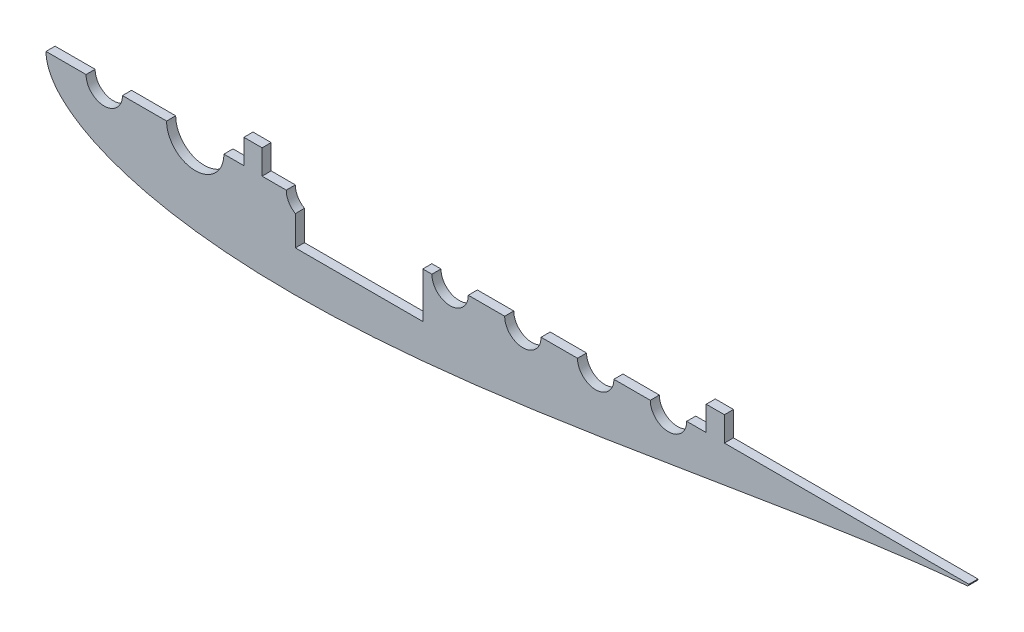
ISO-10303-21;
HEADER;
FILE_DESCRIPTION(('STEP AP214'),'2;1');
FILE_NAME('part.step','',(''),(''),'','','');
FILE_SCHEMA(('AUTOMOTIVE_DESIGN { 1 0 10303 214 1 1 1 1 }'));
ENDSEC;
DATA;
#1=APPLICATION_CONTEXT('core data for automotive mechanical design processes');
#2=APPLICATION_PROTOCOL_DEFINITION('international standard','automotive_design',2000,#1);
#3=PRODUCT_CONTEXT('',#1,'mechanical');
#4=PRODUCT('Part','Part','',(#3));
#5=PRODUCT_RELATED_PRODUCT_CATEGORY('part','',(#4));
#6=PRODUCT_DEFINITION_FORMATION('','',#4);
#7=PRODUCT_DEFINITION_CONTEXT('part definition',#1,'design');
#8=PRODUCT_DEFINITION('design','',#6,#7);
#9=PRODUCT_DEFINITION_SHAPE('','',#8);
#10=(LENGTH_UNIT() NAMED_UNIT(*) SI_UNIT(.MILLI.,.METRE.));
#11=(NAMED_UNIT(*) PLANE_ANGLE_UNIT() SI_UNIT($,.RADIAN.));
#12=(NAMED_UNIT(*) SI_UNIT($,.STERADIAN.) SOLID_ANGLE_UNIT());
#13=UNCERTAINTY_MEASURE_WITH_UNIT(LENGTH_MEASURE(1.E-05),#10,'distance_accuracy_value','');
#14=(GEOMETRIC_REPRESENTATION_CONTEXT(3) GLOBAL_UNCERTAINTY_ASSIGNED_CONTEXT((#13)) GLOBAL_UNIT_ASSIGNED_CONTEXT((#10,
#11,#12)) REPRESENTATION_CONTEXT('',''));
#15=CARTESIAN_POINT('',(0.,0.,0.));
#16=DIRECTION('',(0.,0.,1.));
#17=DIRECTION('',(1.,0.,0.));
#18=AXIS2_PLACEMENT_3D('',#15,#16,#17);
#19=CARTESIAN_POINT('',(0.,0.,6.35));
#20=DIRECTION('',(0.,1.,0.));
#21=DIRECTION('',(0.,0.,1.));
#22=AXIS2_PLACEMENT_3D('',#19,#20,#21);
#23=PLANE('',#22);
#24=DIRECTION('',(1.,0.,0.));
#25=VECTOR('',#24,1.);
#26=CARTESIAN_POINT('',(0.,0.,0.));
#27=LINE('',#26,#25);
#28=CARTESIAN_POINT('',(0.,0.,0.));
#29=VERTEX_POINT('',#28);
#30=CARTESIAN_POINT('',(27.94,0.,0.));
#31=VERTEX_POINT('',#30);
#32=EDGE_CURVE('E323',#29,#31,#27,.T.);
#33=ORIENTED_EDGE('',*,*,#32,.F.);
#34=DIRECTION('',(0.,0.,-1.));
#35=VECTOR('',#34,1.);
#36=CARTESIAN_POINT('',(0.,0.,6.35));
#37=LINE('',#36,#35);
#38=CARTESIAN_POINT('',(0.,0.,6.35));
#39=VERTEX_POINT('',#38);
#40=EDGE_CURVE('E11',#39,#29,#37,.T.);
#41=ORIENTED_EDGE('',*,*,#40,.F.);
#42=DIRECTION('',(1.,0.,0.));
#43=VECTOR('',#42,1.);
#44=CARTESIAN_POINT('',(0.,0.,6.35));
#45=LINE('',#44,#43);
#46=CARTESIAN_POINT('',(27.94,0.,6.35));
#47=VERTEX_POINT('',#46);
#48=EDGE_CURVE('E247',#39,#47,#45,.T.);
#49=ORIENTED_EDGE('',*,*,#48,.T.);
#50=DIRECTION('',(0.,0.,-1.));
#51=VECTOR('',#50,1.);
#52=CARTESIAN_POINT('',(27.94,0.,6.35));
#53=LINE('',#52,#51);
#54=EDGE_CURVE('E52',#47,#31,#53,.T.);
#55=ORIENTED_EDGE('',*,*,#54,.T.);
#56=EDGE_LOOP('',(#33,#41,#49,#55));
#57=FACE_BOUND('',#56,.T.);
#58=ADVANCED_FACE('F34',(#57),#23,.T.);
#59=CARTESIAN_POINT('',(670.56,0.,6.35));
#60=CARTESIAN_POINT('',(670.56,0.0156785949268131,6.35));
#61=CARTESIAN_POINT('',(666.344759682885,0.0546967077380254,6.35));
#62=CARTESIAN_POINT('',(662.850933167967,0.234427605388554,6.35));
#63=CARTESIAN_POINT('',(656.504964310749,0.543558382914671,6.35));
#64=CARTESIAN_POINT('',(649.292951764021,1.03477125279464,6.35));
#65=CARTESIAN_POINT('',(640.49155963975,1.73191957841822,6.35));
#66=CARTESIAN_POINT('',(630.413817461935,2.6633854932203,6.35));
#67=CARTESIAN_POINT('',(619.014124193102,3.84925366408521,6.35));
#68=CARTESIAN_POINT('',(606.37498851238,5.30442898343123,6.35));
#69=CARTESIAN_POINT('',(592.543922516217,7.03763490710039,6.35));
#70=CARTESIAN_POINT('',(577.585454095337,9.05063614704163,6.35));
#71=CARTESIAN_POINT('',(561.564270734499,11.338919624911,6.35));
#72=CARTESIAN_POINT('',(544.549749945783,13.8906653749143,6.35));
#73=CARTESIAN_POINT('',(526.614143657614,16.687720752969,6.35));
#74=CARTESIAN_POINT('',(507.832591566438,19.705111662944,6.35));
#75=CARTESIAN_POINT('',(488.28271028846,22.9116726009051,6.35));
#76=CARTESIAN_POINT('',(468.04436773457,26.2704360601485,6.35));
#77=CARTESIAN_POINT('',(447.199424328287,29.7390074319526,6.35));
#78=CARTESIAN_POINT('',(425.831595832134,33.2703241206413,6.35));
#79=CARTESIAN_POINT('',(404.026315660115,36.8132205450789,6.35));
#80=CARTESIAN_POINT('',(381.870662855574,40.3132668564462,6.35));
#81=CARTESIAN_POINT('',(359.45331489519,43.7135025323023,6.35));
#82=CARTESIAN_POINT('',(336.864544150043,46.9554474567625,6.35));
#83=CARTESIAN_POINT('',(314.196207315012,49.9798438951445,6.35));
#84=CARTESIAN_POINT('',(291.541767703989,52.7277127038914,6.35));
#85=CARTESIAN_POINT('',(268.996310773138,55.1412010116265,6.35));
#86=CARTESIAN_POINT('',(246.656558649997,57.164603828805,6.35));
#87=CARTESIAN_POINT('',(224.620860897201,58.7451766411797,6.35));
#88=CARTESIAN_POINT('',(202.989192599403,59.8341217002378,6.35));
#89=CARTESIAN_POINT('',(181.863132616042,60.38750614212,6.35));
#90=CARTESIAN_POINT('',(161.345829026568,60.3669613241372,6.35));
#91=CARTESIAN_POINT('',(141.542033827972,59.7398958243377,6.35));
#92=CARTESIAN_POINT('',(122.558104572902,58.4817581038394,6.35));
#93=CARTESIAN_POINT('',(104.502313427195,56.5743039322433,6.35));
#94=CARTESIAN_POINT('',(87.4850186361547,54.0089351991654,6.35));
#95=CARTESIAN_POINT('',(71.6196960831899,50.7847520029957,6.35));
#96=CARTESIAN_POINT('',(57.0237097246999,46.9125430655859,6.35));
#97=CARTESIAN_POINT('',(43.8204543300276,42.4150024601016,6.35));
#98=CARTESIAN_POINT('',(32.1416452388822,37.3322040286461,6.35));
#99=CARTESIAN_POINT('',(22.1291073753192,31.7314553388245,6.35));
#100=CARTESIAN_POINT('',(13.9324235239131,25.7264121059535,6.35));
#101=CARTESIAN_POINT('',(7.6896164890983,19.5132076319135,6.35));
#102=CARTESIAN_POINT('',(3.46313634309125,13.420354420661,6.35));
#103=CARTESIAN_POINT('',(1.10633322756685,7.92338943472272,6.35));
#104=CARTESIAN_POINT('',(0.15461158157361,3.51379661507287,6.35));
#105=CARTESIAN_POINT('',(-0.0621515976067641,1.5591281566194E-13,6.35));
#106=CARTESIAN_POINT('',(0.154611581573626,-3.51379661507311,6.35));
#107=CARTESIAN_POINT('',(1.10633322756686,-7.92338943472269,6.35));
#108=CARTESIAN_POINT('',(3.46313634309125,-13.420354420661,6.35));
#109=CARTESIAN_POINT('',(7.68961648909825,-19.5132076319134,6.35));
#110=CARTESIAN_POINT('',(13.9324235239131,-25.7264121059535,6.35));
#111=CARTESIAN_POINT('',(22.1291073753193,-31.7314553388245,6.35));
#112=CARTESIAN_POINT('',(32.1416452388821,-37.3322040286461,6.35));
#113=CARTESIAN_POINT('',(43.8204543300276,-42.4150024601017,6.35));
#114=CARTESIAN_POINT('',(57.0237097246998,-46.9125430655859,6.35));
#115=CARTESIAN_POINT('',(71.6196960831899,-50.7847520029958,6.35));
#116=CARTESIAN_POINT('',(87.4850186361546,-54.0089351991654,6.35));
#117=CARTESIAN_POINT('',(104.502313427195,-56.5743039322434,6.35));
#118=CARTESIAN_POINT('',(122.558104572901,-58.4817581038394,6.35));
#119=CARTESIAN_POINT('',(141.542033827972,-59.7398958243377,6.35));
#120=CARTESIAN_POINT('',(161.345829026568,-60.3669613241371,6.35));
#121=CARTESIAN_POINT('',(181.863132616042,-60.38750614212,6.35));
#122=CARTESIAN_POINT('',(202.989192599403,-59.8341217002379,6.35));
#123=CARTESIAN_POINT('',(224.620860897201,-58.7451766411797,6.35));
#124=CARTESIAN_POINT('',(246.656558649997,-57.164603828805,6.35));
#125=CARTESIAN_POINT('',(268.996310773138,-55.1412010116265,6.35));
#126=CARTESIAN_POINT('',(291.541767703989,-52.7277127038914,6.35));
#127=CARTESIAN_POINT('',(314.196207315012,-49.9798438951445,6.35));
#128=CARTESIAN_POINT('',(336.864544150043,-46.9554474567625,6.35));
#129=CARTESIAN_POINT('',(359.45331489519,-43.7135025323023,6.35));
#130=CARTESIAN_POINT('',(381.870662855574,-40.3132668564462,6.35));
#131=CARTESIAN_POINT('',(404.026315660115,-36.8132205450789,6.35));
#132=CARTESIAN_POINT('',(425.831595832134,-33.2703241206413,6.35));
#133=CARTESIAN_POINT('',(447.199424328287,-29.7390074319526,6.35));
#134=CARTESIAN_POINT('',(468.04436773457,-26.2704360601485,6.35));
#135=CARTESIAN_POINT('',(488.28271028846,-22.911672600905,6.35));
#136=CARTESIAN_POINT('',(507.832591566438,-19.7051116629441,6.35));
#137=CARTESIAN_POINT('',(526.614143657614,-16.687720752969,6.35));
#138=CARTESIAN_POINT('',(544.549749945782,-13.8906653749143,6.35));
#139=CARTESIAN_POINT('',(561.564270734499,-11.338919624911,6.35));
#140=CARTESIAN_POINT('',(577.585454095337,-9.05063614704163,6.35));
#141=CARTESIAN_POINT('',(592.543922516217,-7.03763490710038,6.35));
#142=CARTESIAN_POINT('',(606.37498851238,-5.30442898343123,6.35));
#143=CARTESIAN_POINT('',(619.014124193101,-3.84925366408522,6.35));
#144=CARTESIAN_POINT('',(630.413817461935,-2.6633854932203,6.35));
#145=CARTESIAN_POINT('',(640.491559639751,-1.73191957841821,6.35));
#146=CARTESIAN_POINT('',(649.29295176402,-1.03477125279464,6.35));
#147=CARTESIAN_POINT('',(656.504964310749,-0.543558382914674,6.35));
#148=CARTESIAN_POINT('',(662.850933167967,-0.23442760538855,6.35));
#149=CARTESIAN_POINT('',(666.344759682885,-0.0546967077380269,6.35));
#150=CARTESIAN_POINT('',(670.56,-0.0156785949268135,6.35));
#151=CARTESIAN_POINT('',(670.56,0.,6.35));
#152=B_SPLINE_CURVE_WITH_KNOTS('',3,(#59,#60,#61,#62,#63,#64,#65,#66,#67,#68,#69,#70,#71,#72,
#73,#74,#75,#76,#77,#78,#79,#80,#81,#82,#83,#84,#85,#86,#87,#88,#89,#90,#91,#92,#93,#94,#95,#96,
#97,#98,#99,#100,#101,#102,#103,#104,#105,#106,#107,#108,#109,#110,#111,#112,#113,#114,#115,
#116,#117,#118,#119,#120,#121,#122,#123,#124,#125,#126,#127,#128,#129,#130,#131,#132,#133,#134,
#135,#136,#137,#138,#139,#140,#141,#142,#143,#144,#145,#146,#147,#148,#149,#150,#151),
.UNSPECIFIED.,.T.,.F.,(4,1,1,1,1,1,1,1,1,1,1,1,1,1,1,1,1,1,1,1,1,1,1,1,1,1,1,1,1,1,1,1,1,1,1,1,
1,1,1,1,1,1,1,1,1,1,1,1,1,1,1,1,1,1,1,1,1,1,1,1,1,1,1,1,1,1,1,1,1,1,1,1,1,1,1,1,1,1,1,1,1,1,1,1,
1,1,1,1,1,1,4),(0.,0.00216777795588342,0.00539478220000884,0.00966720698444134,
0.0149667883303173,0.0212708876900959,0.0285525550130683,0.0367806836725549,0.0459201019032637,
0.0559317636633187,0.0667728836144854,0.0783971303496518,0.0907548266908363,0.103793164577546,
0.117456431914319,0.131686225652521,0.146421738497113,0.161599998000845,0.177156132626574,
0.193023668070302,0.209134785631037,0.225420632511523,0.241811601924249,0.258237646860869,
0.274628556698349,0.290914287398014,0.307025228908797,0.322892517177238,0.33844834182358,
0.353626206573582,0.368361231970712,0.382590427827798,0.396252960572084,0.40929041186716,
0.421647009590256,0.433269881487031,0.444109248914041,0.454118639688981,0.463255054987312,
0.471479113777303,0.478755288570903,0.485052318112802,0.490344025694165,0.494609832614287,
0.497833231437255,0.5,0.502166768562745,0.505390167385713,0.509655974305835,0.514947681887198,
0.521244711429097,0.528520886222697,0.536744945012688,0.545881360311019,0.555890751085959,
0.566730118512969,0.578352990409744,0.59070958813284,0.603747039427916,0.617409572172202,
0.631638768029288,0.646373793426418,0.66155165817642,0.677107482822761,0.692974771091203,
0.709085712601986,0.725371443301651,0.741762353139131,0.758188398075751,0.774579367488477,
0.790865214368963,0.806976331929698,0.822843867373426,0.838400001999155,0.853578261502887,
0.868313774347479,0.882543568085681,0.896206835422454,0.909245173309164,0.921602869650348,
0.933227116385514,0.944068236336681,0.954079898096736,0.963219316327445,0.971447444986932,
0.978729112309904,0.985033211669683,0.990332793015559,0.994605217799991,0.997832222044117,1.),.UNSPECIFIED.);
#153=DIRECTION('',(0.,0.,-1.));
#154=VECTOR('',#153,1.);
#155=SURFACE_OF_LINEAR_EXTRUSION('',#152,#154);
#156=CARTESIAN_POINT('',(670.56,0.,0.));
#157=CARTESIAN_POINT('',(670.56,0.0156785949268131,0.));
#158=CARTESIAN_POINT('',(666.344759682885,0.0546967077380254,0.));
#159=CARTESIAN_POINT('',(662.850933167967,0.234427605388554,0.));
#160=CARTESIAN_POINT('',(656.504964310749,0.543558382914671,0.));
#161=CARTESIAN_POINT('',(649.292951764021,1.03477125279464,0.));
#162=CARTESIAN_POINT('',(640.49155963975,1.73191957841822,0.));
#163=CARTESIAN_POINT('',(630.413817461935,2.6633854932203,0.));
#164=CARTESIAN_POINT('',(619.014124193102,3.84925366408521,0.));
#165=CARTESIAN_POINT('',(606.37498851238,5.30442898343123,0.));
#166=CARTESIAN_POINT('',(592.543922516217,7.03763490710039,0.));
#167=CARTESIAN_POINT('',(577.585454095337,9.05063614704163,0.));
#168=CARTESIAN_POINT('',(561.564270734499,11.338919624911,0.));
#169=CARTESIAN_POINT('',(544.549749945783,13.8906653749143,0.));
#170=CARTESIAN_POINT('',(526.614143657614,16.687720752969,0.));
#171=CARTESIAN_POINT('',(507.832591566438,19.705111662944,0.));
#172=CARTESIAN_POINT('',(488.28271028846,22.9116726009051,0.));
#173=CARTESIAN_POINT('',(468.04436773457,26.2704360601485,0.));
#174=CARTESIAN_POINT('',(447.199424328287,29.7390074319526,0.));
#175=CARTESIAN_POINT('',(425.831595832134,33.2703241206413,0.));
#176=CARTESIAN_POINT('',(404.026315660115,36.8132205450789,0.));
#177=CARTESIAN_POINT('',(381.870662855574,40.3132668564462,0.));
#178=CARTESIAN_POINT('',(359.45331489519,43.7135025323023,0.));
#179=CARTESIAN_POINT('',(336.864544150043,46.9554474567625,0.));
#180=CARTESIAN_POINT('',(314.196207315012,49.9798438951445,0.));
#181=CARTESIAN_POINT('',(291.541767703989,52.7277127038914,0.));
#182=CARTESIAN_POINT('',(268.996310773138,55.1412010116265,0.));
#183=CARTESIAN_POINT('',(246.656558649997,57.164603828805,0.));
#184=CARTESIAN_POINT('',(224.620860897201,58.7451766411797,0.));
#185=CARTESIAN_POINT('',(202.989192599403,59.8341217002378,0.));
#186=CARTESIAN_POINT('',(181.863132616042,60.38750614212,0.));
#187=CARTESIAN_POINT('',(161.345829026568,60.3669613241372,0.));
#188=CARTESIAN_POINT('',(141.542033827972,59.7398958243377,0.));
#189=CARTESIAN_POINT('',(122.558104572902,58.4817581038394,0.));
#190=CARTESIAN_POINT('',(104.502313427195,56.5743039322433,0.));
#191=CARTESIAN_POINT('',(87.4850186361547,54.0089351991654,0.));
#192=CARTESIAN_POINT('',(71.6196960831899,50.7847520029957,0.));
#193=CARTESIAN_POINT('',(57.0237097246999,46.9125430655859,0.));
#194=CARTESIAN_POINT('',(43.8204543300276,42.4150024601016,0.));
#195=CARTESIAN_POINT('',(32.1416452388822,37.3322040286461,0.));
#196=CARTESIAN_POINT('',(22.1291073753192,31.7314553388245,0.));
#197=CARTESIAN_POINT('',(13.9324235239131,25.7264121059535,0.));
#198=CARTESIAN_POINT('',(7.6896164890983,19.5132076319135,0.));
#199=CARTESIAN_POINT('',(3.46313634309125,13.420354420661,0.));
#200=CARTESIAN_POINT('',(1.10633322756685,7.92338943472272,0.));
#201=CARTESIAN_POINT('',(0.15461158157361,3.51379661507287,0.));
#202=CARTESIAN_POINT('',(-0.0621515976067641,1.5591281566194E-13,0.));
#203=CARTESIAN_POINT('',(0.154611581573626,-3.51379661507311,0.));
#204=CARTESIAN_POINT('',(1.10633322756686,-7.92338943472269,0.));
#205=CARTESIAN_POINT('',(3.46313634309125,-13.420354420661,0.));
#206=CARTESIAN_POINT('',(7.68961648909825,-19.5132076319134,0.));
#207=CARTESIAN_POINT('',(13.9324235239131,-25.7264121059535,0.));
#208=CARTESIAN_POINT('',(22.1291073753193,-31.7314553388245,0.));
#209=CARTESIAN_POINT('',(32.1416452388821,-37.3322040286461,0.));
#210=CARTESIAN_POINT('',(43.8204543300276,-42.4150024601017,0.));
#211=CARTESIAN_POINT('',(57.0237097246998,-46.9125430655859,0.));
#212=CARTESIAN_POINT('',(71.6196960831899,-50.7847520029958,0.));
#213=CARTESIAN_POINT('',(87.4850186361546,-54.0089351991654,0.));
#214=CARTESIAN_POINT('',(104.502313427195,-56.5743039322434,0.));
#215=CARTESIAN_POINT('',(122.558104572901,-58.4817581038394,0.));
#216=CARTESIAN_POINT('',(141.542033827972,-59.7398958243377,0.));
#217=CARTESIAN_POINT('',(161.345829026568,-60.3669613241371,0.));
#218=CARTESIAN_POINT('',(181.863132616042,-60.38750614212,0.));
#219=CARTESIAN_POINT('',(202.989192599403,-59.8341217002379,0.));
#220=CARTESIAN_POINT('',(224.620860897201,-58.7451766411797,0.));
#221=CARTESIAN_POINT('',(246.656558649997,-57.164603828805,0.));
#222=CARTESIAN_POINT('',(268.996310773138,-55.1412010116265,0.));
#223=CARTESIAN_POINT('',(291.541767703989,-52.7277127038914,0.));
#224=CARTESIAN_POINT('',(314.196207315012,-49.9798438951445,0.));
#225=CARTESIAN_POINT('',(336.864544150043,-46.9554474567625,0.));
#226=CARTESIAN_POINT('',(359.45331489519,-43.7135025323023,0.));
#227=CARTESIAN_POINT('',(381.870662855574,-40.3132668564462,0.));
#228=CARTESIAN_POINT('',(404.026315660115,-36.8132205450789,0.));
#229=CARTESIAN_POINT('',(425.831595832134,-33.2703241206413,0.));
#230=CARTESIAN_POINT('',(447.199424328287,-29.7390074319526,0.));
#231=CARTESIAN_POINT('',(468.04436773457,-26.2704360601485,0.));
#232=CARTESIAN_POINT('',(488.28271028846,-22.911672600905,0.));
#233=CARTESIAN_POINT('',(507.832591566438,-19.7051116629441,0.));
#234=CARTESIAN_POINT('',(526.614143657614,-16.687720752969,0.));
#235=CARTESIAN_POINT('',(544.549749945782,-13.8906653749143,0.));
#236=CARTESIAN_POINT('',(561.564270734499,-11.338919624911,0.));
#237=CARTESIAN_POINT('',(577.585454095337,-9.05063614704163,0.));
#238=CARTESIAN_POINT('',(592.543922516217,-7.03763490710038,0.));
#239=CARTESIAN_POINT('',(606.37498851238,-5.30442898343123,0.));
#240=CARTESIAN_POINT('',(619.014124193101,-3.84925366408522,0.));
#241=CARTESIAN_POINT('',(630.413817461935,-2.6633854932203,0.));
#242=CARTESIAN_POINT('',(640.491559639751,-1.73191957841821,0.));
#243=CARTESIAN_POINT('',(649.29295176402,-1.03477125279464,0.));
#244=CARTESIAN_POINT('',(656.504964310749,-0.543558382914674,0.));
#245=CARTESIAN_POINT('',(662.850933167967,-0.23442760538855,0.));
#246=CARTESIAN_POINT('',(666.344759682885,-0.0546967077380269,0.));
#247=CARTESIAN_POINT('',(670.56,-0.0156785949268135,0.));
#248=CARTESIAN_POINT('',(670.56,0.,0.));
#249=B_SPLINE_CURVE_WITH_KNOTS('',3,(#156,#157,#158,#159,#160,#161,#162,#163,#164,#165,#166,
#167,#168,#169,#170,#171,#172,#173,#174,#175,#176,#177,#178,#179,#180,#181,#182,#183,#184,#185,
#186,#187,#188,#189,#190,#191,#192,#193,#194,#195,#196,#197,#198,#199,#200,#201,#202,#203,#204,
#205,#206,#207,#208,#209,#210,#211,#212,#213,#214,#215,#216,#217,#218,#219,#220,#221,#222,#223,
#224,#225,#226,#227,#228,#229,#230,#231,#232,#233,#234,#235,#236,#237,#238,#239,#240,#241,#242,
#243,#244,#245,#246,#247,#248),.UNSPECIFIED.,.T.,.F.,(4,1,1,1,1,1,1,1,1,1,1,1,1,1,1,1,1,1,1,1,1,
1,1,1,1,1,1,1,1,1,1,1,1,1,1,1,1,1,1,1,1,1,1,1,1,1,1,1,1,1,1,1,1,1,1,1,1,1,1,1,1,1,1,1,1,1,1,1,1,
1,1,1,1,1,1,1,1,1,1,1,1,1,1,1,1,1,1,1,1,1,4),(0.,0.00216777795588342,0.00539478220000884,
0.00966720698444134,0.0149667883303173,0.0212708876900959,0.0285525550130683,0.0367806836725549,
0.0459201019032637,0.0559317636633187,0.0667728836144854,0.0783971303496518,0.0907548266908363,
0.103793164577546,0.117456431914319,0.131686225652521,0.146421738497113,0.161599998000845,
0.177156132626574,0.193023668070302,0.209134785631037,0.225420632511523,0.241811601924249,
0.258237646860869,0.274628556698349,0.290914287398014,0.307025228908797,0.322892517177238,
0.33844834182358,0.353626206573582,0.368361231970712,0.382590427827798,0.396252960572084,
0.40929041186716,0.421647009590256,0.433269881487031,0.444109248914041,0.454118639688981,
0.463255054987312,0.471479113777303,0.478755288570903,0.485052318112802,0.490344025694165,
0.494609832614287,0.497833231437255,0.5,0.502166768562745,0.505390167385713,0.509655974305835,
0.514947681887198,0.521244711429097,0.528520886222697,0.536744945012688,0.545881360311019,
0.555890751085959,0.566730118512969,0.578352990409744,0.59070958813284,0.603747039427916,
0.617409572172202,0.631638768029288,0.646373793426418,0.66155165817642,0.677107482822761,
0.692974771091203,0.709085712601986,0.725371443301651,0.741762353139131,0.758188398075751,
0.774579367488477,0.790865214368963,0.806976331929698,0.822843867373426,0.838400001999155,
0.853578261502887,0.868313774347479,0.882543568085681,0.896206835422454,0.909245173309164,
0.921602869650348,0.933227116385514,0.944068236336681,0.954079898096736,0.963219316327445,
0.971447444986932,0.978729112309904,0.985033211669683,0.990332793015559,0.994605217799991,
0.997832222044117,1.),.UNSPECIFIED.);
#250=CARTESIAN_POINT('',(642.510849283044,-1.58203911233971,0.));
#251=VERTEX_POINT('',#250);
#252=EDGE_CURVE('E325',#29,#251,#249,.T.);
#253=ORIENTED_EDGE('',*,*,#252,.T.);
#254=DIRECTION('',(0.,0.,-1.));
#255=VECTOR('',#254,1.);
#256=CARTESIAN_POINT('',(642.510849283044,-1.58203911233971,6.35));
#257=LINE('',#256,#255);
#258=CARTESIAN_POINT('',(642.510849283044,-1.58203911233971,6.35));
#259=VERTEX_POINT('',#258);
#260=EDGE_CURVE('E44',#259,#251,#257,.T.);
#261=ORIENTED_EDGE('',*,*,#260,.F.);
#262=EDGE_CURVE('E251',#39,#259,#152,.T.);
#263=ORIENTED_EDGE('',*,*,#262,.F.);
#264=ORIENTED_EDGE('',*,*,#40,.T.);
#265=EDGE_LOOP('',(#253,#261,#263,#264));
#266=FACE_BOUND('',#265,.T.);
#267=ADVANCED_FACE('F36',(#266),#155,.F.);
#268=CARTESIAN_POINT('',(642.379287521778,0.,6.35));
#269=DIRECTION('',(0.,0.,-1.));
#270=DIRECTION('',(-1.,0.,0.));
#271=AXIS2_PLACEMENT_3D('',#268,#269,#270);
#272=CYLINDRICAL_SURFACE('',#271,1.58750000000001);
#273=CARTESIAN_POINT('',(642.379287521778,0.,0.));
#274=DIRECTION('',(0.,0.,1.));
#275=DIRECTION('',(1.,0.,0.));
#276=AXIS2_PLACEMENT_3D('',#273,#274,#275);
#277=CIRCLE('',#276,1.58750000000001);
#278=CARTESIAN_POINT('',(643.966787521778,0.,0.));
#279=VERTEX_POINT('',#278);
#280=EDGE_CURVE('E330',#251,#279,#277,.T.);
#281=ORIENTED_EDGE('',*,*,#280,.T.);
#282=DIRECTION('',(0.,0.,-1.));
#283=VECTOR('',#282,1.);
#284=CARTESIAN_POINT('',(643.966787521778,0.,6.35));
#285=LINE('',#284,#283);
#286=CARTESIAN_POINT('',(643.966787521778,0.,6.35));
#287=VERTEX_POINT('',#286);
#288=EDGE_CURVE('E431',#287,#279,#285,.T.);
#289=ORIENTED_EDGE('',*,*,#288,.F.);
#290=CARTESIAN_POINT('',(642.379287521778,0.,6.35));
#291=DIRECTION('',(0.,0.,1.));
#292=DIRECTION('',(1.,0.,0.));
#293=AXIS2_PLACEMENT_3D('',#290,#291,#292);
#294=CIRCLE('',#293,1.58750000000001);
#295=EDGE_CURVE('E254',#259,#287,#294,.T.);
#296=ORIENTED_EDGE('',*,*,#295,.F.);
#297=ORIENTED_EDGE('',*,*,#260,.T.);
#298=EDGE_LOOP('',(#281,#289,#296,#297));
#299=FACE_BOUND('',#298,.T.);
#300=ADVANCED_FACE('F437',(#299),#272,.T.);
#301=CARTESIAN_POINT('',(473.360965278708,0.,0.));
#302=VERTEX_POINT('',#301);
#303=EDGE_CURVE('E326',#302,#279,#27,.T.);
#304=ORIENTED_EDGE('',*,*,#303,.F.);
#305=DIRECTION('',(0.,0.,-1.));
#306=VECTOR('',#305,1.);
#307=CARTESIAN_POINT('',(473.360965278708,0.,6.35));
#308=LINE('',#307,#306);
#309=CARTESIAN_POINT('',(473.360965278708,0.,6.35));
#310=VERTEX_POINT('',#309);
#311=EDGE_CURVE('E429',#310,#302,#308,.T.);
#312=ORIENTED_EDGE('',*,*,#311,.F.);
#313=EDGE_CURVE('E253',#310,#287,#45,.T.);
#314=ORIENTED_EDGE('',*,*,#313,.T.);
#315=ORIENTED_EDGE('',*,*,#288,.T.);
#316=EDGE_LOOP('',(#304,#312,#314,#315));
#317=FACE_BOUND('',#316,.T.);
#318=ADVANCED_FACE('F474',(#317),#23,.T.);
#319=CARTESIAN_POINT('',(473.360965278708,0.,6.35));
#320=DIRECTION('',(-1.,0.,0.));
#321=DIRECTION('',(0.,0.,1.));
#322=AXIS2_PLACEMENT_3D('',#319,#320,#321);
#323=PLANE('',#322);
#324=DIRECTION('',(0.,1.,0.));
#325=VECTOR('',#324,1.);
#326=CARTESIAN_POINT('',(473.360965278708,0.,0.));
#327=LINE('',#326,#325);
#328=CARTESIAN_POINT('',(473.360965278708,17.145,0.));
#329=VERTEX_POINT('',#328);
#330=EDGE_CURVE('E336',#302,#329,#327,.T.);
#331=ORIENTED_EDGE('',*,*,#330,.T.);
#332=DIRECTION('',(0.,0.,-1.));
#333=VECTOR('',#332,1.);
#334=CARTESIAN_POINT('',(473.360965278708,17.145,6.35));
#335=LINE('',#334,#333);
#336=CARTESIAN_POINT('',(473.360965278708,17.145,6.35));
#337=VERTEX_POINT('',#336);
#338=EDGE_CURVE('E427',#337,#329,#335,.T.);
#339=ORIENTED_EDGE('',*,*,#338,.F.);
#340=DIRECTION('',(0.,1.,0.));
#341=VECTOR('',#340,1.);
#342=CARTESIAN_POINT('',(473.360965278708,0.,6.35));
#343=LINE('',#342,#341);
#344=EDGE_CURVE('E259',#310,#337,#343,.T.);
#345=ORIENTED_EDGE('',*,*,#344,.F.);
#346=ORIENTED_EDGE('',*,*,#311,.T.);
#347=EDGE_LOOP('',(#331,#339,#345,#346));
#348=FACE_BOUND('',#347,.T.);
#349=ADVANCED_FACE('F480',(#348),#323,.F.);
#350=CARTESIAN_POINT('',(0.,17.145,6.35));
#351=DIRECTION('',(0.,1.,0.));
#352=DIRECTION('',(0.,0.,1.));
#353=AXIS2_PLACEMENT_3D('',#350,#351,#352);
#354=PLANE('',#353);
#355=DIRECTION('',(1.,0.,0.));
#356=VECTOR('',#355,1.);
#357=CARTESIAN_POINT('',(0.,17.145,0.));
#358=LINE('',#357,#356);
#359=CARTESIAN_POINT('',(460.660965278708,17.145,0.));
#360=VERTEX_POINT('',#359);
#361=EDGE_CURVE('E339',#360,#329,#358,.T.);
#362=ORIENTED_EDGE('',*,*,#361,.F.);
#363=DIRECTION('',(0.,0.,-1.));
#364=VECTOR('',#363,1.);
#365=CARTESIAN_POINT('',(460.660965278708,17.145,6.35));
#366=LINE('',#365,#364);
#367=CARTESIAN_POINT('',(460.660965278708,17.145,6.35));
#368=VERTEX_POINT('',#367);
#369=EDGE_CURVE('E425',#368,#360,#366,.T.);
#370=ORIENTED_EDGE('',*,*,#369,.F.);
#371=DIRECTION('',(1.,0.,0.));
#372=VECTOR('',#371,1.);
#373=CARTESIAN_POINT('',(0.,17.145,6.35));
#374=LINE('',#373,#372);
#375=EDGE_CURVE('E263',#368,#337,#374,.T.);
#376=ORIENTED_EDGE('',*,*,#375,.T.);
#377=ORIENTED_EDGE('',*,*,#338,.T.);
#378=EDGE_LOOP('',(#362,#370,#376,#377));
#379=FACE_BOUND('',#378,.T.);
#380=ADVANCED_FACE('F486',(#379),#354,.T.);
#381=CARTESIAN_POINT('',(460.660965278708,1.49150309185906E-12,6.35));
#382=DIRECTION('',(-1.,0.,0.));
#383=DIRECTION('',(0.,-1.,0.));
#384=AXIS2_PLACEMENT_3D('',#381,#382,#383);
#385=PLANE('',#384);
#386=DIRECTION('',(0.,1.,0.));
#387=VECTOR('',#386,1.);
#388=CARTESIAN_POINT('',(460.660965278708,1.49150309185906E-12,0.));
#389=LINE('',#388,#387);
#390=CARTESIAN_POINT('',(460.660965278708,0.,0.));
#391=VERTEX_POINT('',#390);
#392=EDGE_CURVE('E342',#391,#360,#389,.T.);
#393=ORIENTED_EDGE('',*,*,#392,.F.);
#394=DIRECTION('',(0.,0.,-1.));
#395=VECTOR('',#394,1.);
#396=CARTESIAN_POINT('',(460.660965278708,0.,6.35));
#397=LINE('',#396,#395);
#398=CARTESIAN_POINT('',(460.660965278708,0.,6.35));
#399=VERTEX_POINT('',#398);
#400=EDGE_CURVE('E423',#399,#391,#397,.T.);
#401=ORIENTED_EDGE('',*,*,#400,.F.);
#402=DIRECTION('',(0.,1.,0.));
#403=VECTOR('',#402,1.);
#404=CARTESIAN_POINT('',(460.660965278708,1.49150309185906E-12,6.35));
#405=LINE('',#404,#403);
#406=EDGE_CURVE('E268',#399,#368,#405,.T.);
#407=ORIENTED_EDGE('',*,*,#406,.T.);
#408=ORIENTED_EDGE('',*,*,#369,.T.);
#409=EDGE_LOOP('',(#393,#401,#407,#408));
#410=FACE_BOUND('',#409,.T.);
#411=ADVANCED_FACE('F491',(#410),#385,.T.);
#412=CARTESIAN_POINT('',(447.04,0.,0.));
#413=VERTEX_POINT('',#412);
#414=EDGE_CURVE('E345',#413,#391,#27,.T.);
#415=ORIENTED_EDGE('',*,*,#414,.F.);
#416=DIRECTION('',(0.,0.,-1.));
#417=VECTOR('',#416,1.);
#418=CARTESIAN_POINT('',(447.04,0.,6.35));
#419=LINE('',#418,#417);
#420=CARTESIAN_POINT('',(447.04,0.,6.35));
#421=VERTEX_POINT('',#420);
#422=EDGE_CURVE('E421',#421,#413,#419,.T.);
#423=ORIENTED_EDGE('',*,*,#422,.F.);
#424=EDGE_CURVE('E260',#421,#399,#45,.T.);
#425=ORIENTED_EDGE('',*,*,#424,.T.);
#426=ORIENTED_EDGE('',*,*,#400,.T.);
#427=EDGE_LOOP('',(#415,#423,#425,#426));
#428=FACE_BOUND('',#427,.T.);
#429=ADVANCED_FACE('F481',(#428),#23,.T.);
#430=CARTESIAN_POINT('',(434.34,0.,6.35));
#431=DIRECTION('',(0.,0.,-1.));
#432=DIRECTION('',(-1.,0.,0.));
#433=AXIS2_PLACEMENT_3D('',#430,#431,#432);
#434=CYLINDRICAL_SURFACE('',#433,12.7);
#435=CARTESIAN_POINT('',(434.34,0.,0.));
#436=DIRECTION('',(0.,0.,1.));
#437=DIRECTION('',(1.,0.,0.));
#438=AXIS2_PLACEMENT_3D('',#435,#436,#437);
#439=CIRCLE('',#438,12.7);
#440=CARTESIAN_POINT('',(421.64,0.,0.));
#441=VERTEX_POINT('',#440);
#442=EDGE_CURVE('E346',#441,#413,#439,.T.);
#443=ORIENTED_EDGE('',*,*,#442,.F.);
#444=DIRECTION('',(0.,0.,-1.));
#445=VECTOR('',#444,1.);
#446=CARTESIAN_POINT('',(421.64,0.,6.35));
#447=LINE('',#446,#445);
#448=CARTESIAN_POINT('',(421.64,0.,6.35));
#449=VERTEX_POINT('',#448);
#450=EDGE_CURVE('E419',#449,#441,#447,.T.);
#451=ORIENTED_EDGE('',*,*,#450,.F.);
#452=CARTESIAN_POINT('',(434.34,0.,6.35));
#453=DIRECTION('',(0.,0.,1.));
#454=DIRECTION('',(1.,0.,0.));
#455=AXIS2_PLACEMENT_3D('',#452,#453,#454);
#456=CIRCLE('',#455,12.7);
#457=EDGE_CURVE('E267',#449,#421,#456,.T.);
#458=ORIENTED_EDGE('',*,*,#457,.T.);
#459=ORIENTED_EDGE('',*,*,#422,.T.);
#460=EDGE_LOOP('',(#443,#451,#458,#459));
#461=FACE_BOUND('',#460,.T.);
#462=ADVANCED_FACE('F490',(#461),#434,.F.);
#463=CARTESIAN_POINT('',(396.24,0.,0.));
#464=VERTEX_POINT('',#463);
#465=EDGE_CURVE('E349',#464,#441,#27,.T.);
#466=ORIENTED_EDGE('',*,*,#465,.F.);
#467=DIRECTION('',(0.,0.,-1.));
#468=VECTOR('',#467,1.);
#469=CARTESIAN_POINT('',(396.24,0.,6.35));
#470=LINE('',#469,#468);
#471=CARTESIAN_POINT('',(396.24,0.,6.35));
#472=VERTEX_POINT('',#471);
#473=EDGE_CURVE('E417',#472,#464,#470,.T.);
#474=ORIENTED_EDGE('',*,*,#473,.F.);
#475=EDGE_CURVE('E269',#472,#449,#45,.T.);
#476=ORIENTED_EDGE('',*,*,#475,.T.);
#477=ORIENTED_EDGE('',*,*,#450,.T.);
#478=EDGE_LOOP('',(#466,#474,#476,#477));
#479=FACE_BOUND('',#478,.T.);
#480=ADVANCED_FACE('F492',(#479),#23,.T.);
#481=CARTESIAN_POINT('',(383.54,0.,6.35));
#482=DIRECTION('',(0.,0.,-1.));
#483=DIRECTION('',(-1.,0.,0.));
#484=AXIS2_PLACEMENT_3D('',#481,#482,#483);
#485=CYLINDRICAL_SURFACE('',#484,12.7);
#486=CARTESIAN_POINT('',(383.54,0.,0.));
#487=DIRECTION('',(0.,0.,1.));
#488=DIRECTION('',(1.,0.,0.));
#489=AXIS2_PLACEMENT_3D('',#486,#487,#488);
#490=CIRCLE('',#489,12.7);
#491=CARTESIAN_POINT('',(370.84,0.,0.));
#492=VERTEX_POINT('',#491);
#493=EDGE_CURVE('E350',#492,#464,#490,.T.);
#494=ORIENTED_EDGE('',*,*,#493,.F.);
#495=DIRECTION('',(0.,0.,-1.));
#496=VECTOR('',#495,1.);
#497=CARTESIAN_POINT('',(370.84,0.,6.35));
#498=LINE('',#497,#496);
#499=CARTESIAN_POINT('',(370.84,0.,6.35));
#500=VERTEX_POINT('',#499);
#501=EDGE_CURVE('E415',#500,#492,#498,.T.);
#502=ORIENTED_EDGE('',*,*,#501,.F.);
#503=CARTESIAN_POINT('',(383.54,0.,6.35));
#504=DIRECTION('',(0.,0.,1.));
#505=DIRECTION('',(1.,0.,0.));
#506=AXIS2_PLACEMENT_3D('',#503,#504,#505);
#507=CIRCLE('',#506,12.7);
#508=EDGE_CURVE('E277',#500,#472,#507,.T.);
#509=ORIENTED_EDGE('',*,*,#508,.T.);
#510=ORIENTED_EDGE('',*,*,#473,.T.);
#511=EDGE_LOOP('',(#494,#502,#509,#510));
#512=FACE_BOUND('',#511,.T.);
#513=ADVANCED_FACE('F502',(#512),#485,.F.);
#514=CARTESIAN_POINT('',(345.44,0.,0.));
#515=VERTEX_POINT('',#514);
#516=EDGE_CURVE('E353',#515,#492,#27,.T.);
#517=ORIENTED_EDGE('',*,*,#516,.F.);
#518=DIRECTION('',(0.,0.,-1.));
#519=VECTOR('',#518,1.);
#520=CARTESIAN_POINT('',(345.44,0.,6.35));
#521=LINE('',#520,#519);
#522=CARTESIAN_POINT('',(345.44,0.,6.35));
#523=VERTEX_POINT('',#522);
#524=EDGE_CURVE('E413',#523,#515,#521,.T.);
#525=ORIENTED_EDGE('',*,*,#524,.F.);
#526=EDGE_CURVE('E278',#523,#500,#45,.T.);
#527=ORIENTED_EDGE('',*,*,#526,.T.);
#528=ORIENTED_EDGE('',*,*,#501,.T.);
#529=EDGE_LOOP('',(#517,#525,#527,#528));
#530=FACE_BOUND('',#529,.T.);
#531=ADVANCED_FACE('F503',(#530),#23,.T.);
#532=CARTESIAN_POINT('',(332.74,0.,6.35));
#533=DIRECTION('',(0.,0.,-1.));
#534=DIRECTION('',(-1.,0.,0.));
#535=AXIS2_PLACEMENT_3D('',#532,#533,#534);
#536=CYLINDRICAL_SURFACE('',#535,12.7);
#537=CARTESIAN_POINT('',(332.74,0.,0.));
#538=DIRECTION('',(0.,0.,1.));
#539=DIRECTION('',(1.,0.,0.));
#540=AXIS2_PLACEMENT_3D('',#537,#538,#539);
#541=CIRCLE('',#540,12.7);
#542=CARTESIAN_POINT('',(320.04,0.,0.));
#543=VERTEX_POINT('',#542);
#544=EDGE_CURVE('E354',#543,#515,#541,.T.);
#545=ORIENTED_EDGE('',*,*,#544,.F.);
#546=DIRECTION('',(0.,0.,-1.));
#547=VECTOR('',#546,1.);
#548=CARTESIAN_POINT('',(320.04,0.,6.35));
#549=LINE('',#548,#547);
#550=CARTESIAN_POINT('',(320.04,0.,6.35));
#551=VERTEX_POINT('',#550);
#552=EDGE_CURVE('E411',#551,#543,#549,.T.);
#553=ORIENTED_EDGE('',*,*,#552,.F.);
#554=CARTESIAN_POINT('',(332.74,0.,6.35));
#555=DIRECTION('',(0.,0.,1.));
#556=DIRECTION('',(1.,0.,0.));
#557=AXIS2_PLACEMENT_3D('',#554,#555,#556);
#558=CIRCLE('',#557,12.7);
#559=EDGE_CURVE('E284',#551,#523,#558,.T.);
#560=ORIENTED_EDGE('',*,*,#559,.T.);
#561=ORIENTED_EDGE('',*,*,#524,.T.);
#562=EDGE_LOOP('',(#545,#553,#560,#561));
#563=FACE_BOUND('',#562,.T.);
#564=ADVANCED_FACE('F510',(#563),#536,.F.);
#565=CARTESIAN_POINT('',(294.64,0.,0.));
#566=VERTEX_POINT('',#565);
#567=EDGE_CURVE('E357',#566,#543,#27,.T.);
#568=ORIENTED_EDGE('',*,*,#567,.F.);
#569=DIRECTION('',(0.,0.,-1.));
#570=VECTOR('',#569,1.);
#571=CARTESIAN_POINT('',(294.64,0.,6.35));
#572=LINE('',#571,#570);
#573=CARTESIAN_POINT('',(294.64,0.,6.35));
#574=VERTEX_POINT('',#573);
#575=EDGE_CURVE('E409',#574,#566,#572,.T.);
#576=ORIENTED_EDGE('',*,*,#575,.F.);
#577=EDGE_CURVE('E285',#574,#551,#45,.T.);
#578=ORIENTED_EDGE('',*,*,#577,.T.);
#579=ORIENTED_EDGE('',*,*,#552,.T.);
#580=EDGE_LOOP('',(#568,#576,#578,#579));
#581=FACE_BOUND('',#580,.T.);
#582=ADVANCED_FACE('F511',(#581),#23,.T.);
#583=CARTESIAN_POINT('',(281.94,0.,6.35));
#584=DIRECTION('',(0.,0.,-1.));
#585=DIRECTION('',(-1.,0.,0.));
#586=AXIS2_PLACEMENT_3D('',#583,#584,#585);
#587=CYLINDRICAL_SURFACE('',#586,12.7);
#588=CARTESIAN_POINT('',(281.94,0.,0.));
#589=DIRECTION('',(0.,0.,1.));
#590=DIRECTION('',(1.,0.,0.));
#591=AXIS2_PLACEMENT_3D('',#588,#589,#590);
#592=CIRCLE('',#591,12.7);
#593=CARTESIAN_POINT('',(269.24,0.,0.));
#594=VERTEX_POINT('',#593);
#595=EDGE_CURVE('E358',#594,#566,#592,.T.);
#596=ORIENTED_EDGE('',*,*,#595,.F.);
#597=DIRECTION('',(0.,0.,-1.));
#598=VECTOR('',#597,1.);
#599=CARTESIAN_POINT('',(269.24,0.,6.35));
#600=LINE('',#599,#598);
#601=CARTESIAN_POINT('',(269.24,0.,6.35));
#602=VERTEX_POINT('',#601);
#603=EDGE_CURVE('E407',#602,#594,#600,.T.);
#604=ORIENTED_EDGE('',*,*,#603,.F.);
#605=CARTESIAN_POINT('',(281.94,0.,6.35));
#606=DIRECTION('',(0.,0.,1.));
#607=DIRECTION('',(1.,0.,0.));
#608=AXIS2_PLACEMENT_3D('',#605,#606,#607);
#609=CIRCLE('',#608,12.7);
#610=EDGE_CURVE('E291',#602,#574,#609,.T.);
#611=ORIENTED_EDGE('',*,*,#610,.T.);
#612=ORIENTED_EDGE('',*,*,#575,.T.);
#613=EDGE_LOOP('',(#596,#604,#611,#612));
#614=FACE_BOUND('',#613,.T.);
#615=ADVANCED_FACE('F518',(#614),#587,.F.);
#616=CARTESIAN_POINT('',(262.89,0.,0.));
#617=VERTEX_POINT('',#616);
#618=EDGE_CURVE('E361',#617,#594,#27,.T.);
#619=ORIENTED_EDGE('',*,*,#618,.F.);
#620=DIRECTION('',(0.,0.,-1.));
#621=VECTOR('',#620,1.);
#622=CARTESIAN_POINT('',(262.89,0.,6.35));
#623=LINE('',#622,#621);
#624=CARTESIAN_POINT('',(262.89,0.,6.35));
#625=VERTEX_POINT('',#624);
#626=EDGE_CURVE('E405',#625,#617,#623,.T.);
#627=ORIENTED_EDGE('',*,*,#626,.F.);
#628=EDGE_CURVE('E292',#625,#602,#45,.T.);
#629=ORIENTED_EDGE('',*,*,#628,.T.);
#630=ORIENTED_EDGE('',*,*,#603,.T.);
#631=EDGE_LOOP('',(#619,#627,#629,#630));
#632=FACE_BOUND('',#631,.T.);
#633=ADVANCED_FACE('F519',(#632),#23,.T.);
#634=CARTESIAN_POINT('',(262.89,0.,6.35));
#635=DIRECTION('',(1.,0.,0.));
#636=DIRECTION('',(0.,0.,-1.));
#637=AXIS2_PLACEMENT_3D('',#634,#635,#636);
#638=PLANE('',#637);
#639=DIRECTION('',(0.,-1.,0.));
#640=VECTOR('',#639,1.);
#641=CARTESIAN_POINT('',(262.89,0.,0.));
#642=LINE('',#641,#640);
#643=CARTESIAN_POINT('',(262.89,-31.75,0.));
#644=VERTEX_POINT('',#643);
#645=EDGE_CURVE('E362',#617,#644,#642,.T.);
#646=ORIENTED_EDGE('',*,*,#645,.T.);
#647=DIRECTION('',(0.,0.,-1.));
#648=VECTOR('',#647,1.);
#649=CARTESIAN_POINT('',(262.89,-31.75,6.35));
#650=LINE('',#649,#648);
#651=CARTESIAN_POINT('',(262.89,-31.75,6.35));
#652=VERTEX_POINT('',#651);
#653=EDGE_CURVE('E403',#652,#644,#650,.T.);
#654=ORIENTED_EDGE('',*,*,#653,.F.);
#655=DIRECTION('',(0.,-1.,0.));
#656=VECTOR('',#655,1.);
#657=CARTESIAN_POINT('',(262.89,0.,6.35));
#658=LINE('',#657,#656);
#659=EDGE_CURVE('E298',#625,#652,#658,.T.);
#660=ORIENTED_EDGE('',*,*,#659,.F.);
#661=ORIENTED_EDGE('',*,*,#626,.T.);
#662=EDGE_LOOP('',(#646,#654,#660,#661));
#663=FACE_BOUND('',#662,.T.);
#664=ADVANCED_FACE('F526',(#663),#638,.F.);
#665=CARTESIAN_POINT('',(0.,-31.75,6.35));
#666=DIRECTION('',(0.,1.,0.));
#667=DIRECTION('',(0.,0.,1.));
#668=AXIS2_PLACEMENT_3D('',#665,#666,#667);
#669=PLANE('',#668);
#670=DIRECTION('',(1.,0.,0.));
#671=VECTOR('',#670,1.);
#672=CARTESIAN_POINT('',(0.,-31.75,0.));
#673=LINE('',#672,#671);
#674=CARTESIAN_POINT('',(173.99,-31.75,0.));
#675=VERTEX_POINT('',#674);
#676=EDGE_CURVE('E365',#675,#644,#673,.T.);
#677=ORIENTED_EDGE('',*,*,#676,.F.);
#678=DIRECTION('',(0.,0.,-1.));
#679=VECTOR('',#678,1.);
#680=CARTESIAN_POINT('',(173.99,-31.75,6.35));
#681=LINE('',#680,#679);
#682=CARTESIAN_POINT('',(173.99,-31.75,6.35));
#683=VERTEX_POINT('',#682);
#684=EDGE_CURVE('E401',#683,#675,#681,.T.);
#685=ORIENTED_EDGE('',*,*,#684,.F.);
#686=DIRECTION('',(1.,0.,0.));
#687=VECTOR('',#686,1.);
#688=CARTESIAN_POINT('',(0.,-31.75,6.35));
#689=LINE('',#688,#687);
#690=EDGE_CURVE('E301',#683,#652,#689,.T.);
#691=ORIENTED_EDGE('',*,*,#690,.T.);
#692=ORIENTED_EDGE('',*,*,#653,.T.);
#693=EDGE_LOOP('',(#677,#685,#691,#692));
#694=FACE_BOUND('',#693,.T.);
#695=ADVANCED_FACE('F531',(#694),#669,.T.);
#696=CARTESIAN_POINT('',(173.99,0.,6.35));
#697=DIRECTION('',(1.,0.,0.));
#698=DIRECTION('',(0.,0.,-1.));
#699=AXIS2_PLACEMENT_3D('',#696,#697,#698);
#700=PLANE('',#699);
#701=DIRECTION('',(0.,-1.,0.));
#702=VECTOR('',#701,1.);
#703=CARTESIAN_POINT('',(173.99,0.,0.));
#704=LINE('',#703,#702);
#705=CARTESIAN_POINT('',(173.99,-10.9985226280624,0.));
#706=VERTEX_POINT('',#705);
#707=EDGE_CURVE('E368',#706,#675,#704,.T.);
#708=ORIENTED_EDGE('',*,*,#707,.F.);
#709=DIRECTION('',(0.,0.,-1.));
#710=VECTOR('',#709,1.);
#711=CARTESIAN_POINT('',(173.99,-10.9985226280624,6.35));
#712=LINE('',#711,#710);
#713=CARTESIAN_POINT('',(173.99,-10.9985226280624,6.35));
#714=VERTEX_POINT('',#713);
#715=EDGE_CURVE('E399',#714,#706,#712,.T.);
#716=ORIENTED_EDGE('',*,*,#715,.F.);
#717=DIRECTION('',(0.,-1.,0.));
#718=VECTOR('',#717,1.);
#719=CARTESIAN_POINT('',(173.99,0.,6.35));
#720=LINE('',#719,#718);
#721=EDGE_CURVE('E311',#714,#683,#720,.T.);
#722=ORIENTED_EDGE('',*,*,#721,.T.);
#723=ORIENTED_EDGE('',*,*,#684,.T.);
#724=EDGE_LOOP('',(#708,#716,#722,#723));
#725=FACE_BOUND('',#724,.T.);
#726=ADVANCED_FACE('F544',(#725),#700,.T.);
#727=CARTESIAN_POINT('',(180.34,0.,6.35));
#728=DIRECTION('',(0.,0.,-1.));
#729=DIRECTION('',(-1.,0.,0.));
#730=AXIS2_PLACEMENT_3D('',#727,#728,#729);
#731=CYLINDRICAL_SURFACE('',#730,12.7);
#732=CARTESIAN_POINT('',(180.34,0.,0.));
#733=DIRECTION('',(0.,0.,1.));
#734=DIRECTION('',(1.,0.,0.));
#735=AXIS2_PLACEMENT_3D('',#732,#733,#734);
#736=CIRCLE('',#735,12.7);
#737=CARTESIAN_POINT('',(167.64,0.,0.));
#738=VERTEX_POINT('',#737);
#739=EDGE_CURVE('E371',#738,#706,#736,.T.);
#740=ORIENTED_EDGE('',*,*,#739,.F.);
#741=DIRECTION('',(0.,0.,-1.));
#742=VECTOR('',#741,1.);
#743=CARTESIAN_POINT('',(167.64,0.,6.35));
#744=LINE('',#743,#742);
#745=CARTESIAN_POINT('',(167.64,0.,6.35));
#746=VERTEX_POINT('',#745);
#747=EDGE_CURVE('E397',#746,#738,#744,.T.);
#748=ORIENTED_EDGE('',*,*,#747,.F.);
#749=CARTESIAN_POINT('',(180.34,0.,6.35));
#750=DIRECTION('',(0.,0.,1.));
#751=DIRECTION('',(1.,0.,0.));
#752=AXIS2_PLACEMENT_3D('',#749,#750,#751);
#753=CIRCLE('',#752,12.7);
#754=EDGE_CURVE('E305',#746,#714,#753,.T.);
#755=ORIENTED_EDGE('',*,*,#754,.T.);
#756=ORIENTED_EDGE('',*,*,#715,.T.);
#757=EDGE_LOOP('',(#740,#748,#755,#756));
#758=FACE_BOUND('',#757,.T.);
#759=ADVANCED_FACE('F536',(#758),#731,.F.);
#760=CARTESIAN_POINT('',(150.780965278708,0.,0.));
#761=VERTEX_POINT('',#760);
#762=EDGE_CURVE('E374',#761,#738,#27,.T.);
#763=ORIENTED_EDGE('',*,*,#762,.F.);
#764=DIRECTION('',(0.,0.,-1.));
#765=VECTOR('',#764,1.);
#766=CARTESIAN_POINT('',(150.780965278708,0.,6.35));
#767=LINE('',#766,#765);
#768=CARTESIAN_POINT('',(150.780965278708,0.,6.35));
#769=VERTEX_POINT('',#768);
#770=EDGE_CURVE('E395',#769,#761,#767,.T.);
#771=ORIENTED_EDGE('',*,*,#770,.F.);
#772=EDGE_CURVE('E250',#769,#746,#45,.T.);
#773=ORIENTED_EDGE('',*,*,#772,.T.);
#774=ORIENTED_EDGE('',*,*,#747,.T.);
#775=EDGE_LOOP('',(#763,#771,#773,#774));
#776=FACE_BOUND('',#775,.T.);
#777=ADVANCED_FACE('F527',(#776),#23,.T.);
#778=CARTESIAN_POINT('',(150.780965278708,0.,6.35));
#779=DIRECTION('',(-1.,0.,0.));
#780=DIRECTION('',(0.,0.,1.));
#781=AXIS2_PLACEMENT_3D('',#778,#779,#780);
#782=PLANE('',#781);
#783=DIRECTION('',(0.,1.,0.));
#784=VECTOR('',#783,1.);
#785=CARTESIAN_POINT('',(150.780965278708,0.,0.));
#786=LINE('',#785,#784);
#787=CARTESIAN_POINT('',(150.780965278708,17.1449999999977,0.));
#788=VERTEX_POINT('',#787);
#789=EDGE_CURVE('E375',#761,#788,#786,.T.);
#790=ORIENTED_EDGE('',*,*,#789,.T.);
#791=DIRECTION('',(0.,0.,-1.));
#792=VECTOR('',#791,1.);
#793=CARTESIAN_POINT('',(150.780965278708,17.1449999999977,6.35));
#794=LINE('',#793,#792);
#795=CARTESIAN_POINT('',(150.780965278708,17.1449999999977,6.35));
#796=VERTEX_POINT('',#795);
#797=EDGE_CURVE('E393',#796,#788,#794,.T.);
#798=ORIENTED_EDGE('',*,*,#797,.F.);
#799=DIRECTION('',(0.,1.,0.));
#800=VECTOR('',#799,1.);
#801=CARTESIAN_POINT('',(150.780965278708,0.,6.35));
#802=LINE('',#801,#800);
#803=EDGE_CURVE('E304',#769,#796,#802,.T.);
#804=ORIENTED_EDGE('',*,*,#803,.F.);
#805=ORIENTED_EDGE('',*,*,#770,.T.);
#806=EDGE_LOOP('',(#790,#798,#804,#805));
#807=FACE_BOUND('',#806,.T.);
#808=ADVANCED_FACE('F535',(#807),#782,.F.);
#809=CARTESIAN_POINT('',(0.,17.1449999999977,6.35));
#810=DIRECTION('',(0.,1.,0.));
#811=DIRECTION('',(0.,0.,1.));
#812=AXIS2_PLACEMENT_3D('',#809,#810,#811);
#813=PLANE('',#812);
#814=DIRECTION('',(1.,0.,0.));
#815=VECTOR('',#814,1.);
#816=CARTESIAN_POINT('',(0.,17.1449999999977,0.));
#817=LINE('',#816,#815);
#818=CARTESIAN_POINT('',(138.080965278708,17.1449999999977,0.));
#819=VERTEX_POINT('',#818);
#820=EDGE_CURVE('E378',#819,#788,#817,.T.);
#821=ORIENTED_EDGE('',*,*,#820,.F.);
#822=DIRECTION('',(0.,0.,-1.));
#823=VECTOR('',#822,1.);
#824=CARTESIAN_POINT('',(138.080965278708,17.1449999999977,6.35));
#825=LINE('',#824,#823);
#826=CARTESIAN_POINT('',(138.080965278708,17.1449999999977,6.35));
#827=VERTEX_POINT('',#826);
#828=EDGE_CURVE('E391',#827,#819,#825,.T.);
#829=ORIENTED_EDGE('',*,*,#828,.F.);
#830=DIRECTION('',(1.,0.,0.));
#831=VECTOR('',#830,1.);
#832=CARTESIAN_POINT('',(0.,17.1449999999977,6.35));
#833=LINE('',#832,#831);
#834=EDGE_CURVE('E308',#827,#796,#833,.T.);
#835=ORIENTED_EDGE('',*,*,#834,.T.);
#836=ORIENTED_EDGE('',*,*,#797,.T.);
#837=EDGE_LOOP('',(#821,#829,#835,#836));
#838=FACE_BOUND('',#837,.T.);
#839=ADVANCED_FACE('F541',(#838),#813,.T.);
#840=CARTESIAN_POINT('',(138.080965278708,4.47071061285764E-13,6.35));
#841=DIRECTION('',(-1.,0.,0.));
#842=DIRECTION('',(0.,-1.,0.));
#843=AXIS2_PLACEMENT_3D('',#840,#841,#842);
#844=PLANE('',#843);
#845=DIRECTION('',(0.,1.,0.));
#846=VECTOR('',#845,1.);
#847=CARTESIAN_POINT('',(138.080965278708,4.47071061285764E-13,0.));
#848=LINE('',#847,#846);
#849=CARTESIAN_POINT('',(138.080965278708,0.,0.));
#850=VERTEX_POINT('',#849);
#851=EDGE_CURVE('E381',#850,#819,#848,.T.);
#852=ORIENTED_EDGE('',*,*,#851,.F.);
#853=DIRECTION('',(0.,0.,-1.));
#854=VECTOR('',#853,1.);
#855=CARTESIAN_POINT('',(138.080965278708,0.,6.35));
#856=LINE('',#855,#854);
#857=CARTESIAN_POINT('',(138.080965278708,0.,6.35));
#858=VERTEX_POINT('',#857);
#859=EDGE_CURVE('E389',#858,#850,#856,.T.);
#860=ORIENTED_EDGE('',*,*,#859,.F.);
#861=DIRECTION('',(0.,1.,0.));
#862=VECTOR('',#861,1.);
#863=CARTESIAN_POINT('',(138.080965278708,4.47071061285764E-13,6.35));
#864=LINE('',#863,#862);
#865=EDGE_CURVE('E249',#858,#827,#864,.T.);
#866=ORIENTED_EDGE('',*,*,#865,.T.);
#867=ORIENTED_EDGE('',*,*,#828,.T.);
#868=EDGE_LOOP('',(#852,#860,#866,#867));
#869=FACE_BOUND('',#868,.T.);
#870=ADVANCED_FACE('F547',(#869),#844,.T.);
#871=CARTESIAN_POINT('',(124.14,0.,0.));
#872=VERTEX_POINT('',#871);
#873=EDGE_CURVE('E384',#872,#850,#27,.T.);
#874=ORIENTED_EDGE('',*,*,#873,.F.);
#875=DIRECTION('',(0.,0.,-1.));
#876=VECTOR('',#875,1.);
#877=CARTESIAN_POINT('',(124.14,0.,6.35));
#878=LINE('',#877,#876);
#879=CARTESIAN_POINT('',(124.14,0.,6.35));
#880=VERTEX_POINT('',#879);
#881=EDGE_CURVE('E231',#880,#872,#878,.T.);
#882=ORIENTED_EDGE('',*,*,#881,.F.);
#883=EDGE_CURVE('E242',#880,#858,#45,.T.);
#884=ORIENTED_EDGE('',*,*,#883,.T.);
#885=ORIENTED_EDGE('',*,*,#859,.T.);
#886=EDGE_LOOP('',(#874,#882,#884,#885));
#887=FACE_BOUND('',#886,.T.);
#888=ADVANCED_FACE('F471',(#887),#23,.T.);
#889=CARTESIAN_POINT('',(104.14,0.,6.35));
#890=DIRECTION('',(0.,0.,-1.));
#891=DIRECTION('',(-1.,0.,0.));
#892=AXIS2_PLACEMENT_3D('',#889,#890,#891);
#893=CYLINDRICAL_SURFACE('',#892,20.);
#894=CARTESIAN_POINT('',(104.14,0.,0.));
#895=DIRECTION('',(0.,0.,1.));
#896=DIRECTION('',(1.,0.,0.));
#897=AXIS2_PLACEMENT_3D('',#894,#895,#896);
#898=CIRCLE('',#897,20.);
#899=CARTESIAN_POINT('',(84.14,0.,0.));
#900=VERTEX_POINT('',#899);
#901=EDGE_CURVE('E227',#900,#872,#898,.T.);
#902=ORIENTED_EDGE('',*,*,#901,.F.);
#903=DIRECTION('',(0.,0.,-1.));
#904=VECTOR('',#903,1.);
#905=CARTESIAN_POINT('',(84.14,0.,6.35));
#906=LINE('',#905,#904);
#907=CARTESIAN_POINT('',(84.14,0.,6.35));
#908=VERTEX_POINT('',#907);
#909=EDGE_CURVE('E222',#908,#900,#906,.T.);
#910=ORIENTED_EDGE('',*,*,#909,.F.);
#911=CARTESIAN_POINT('',(104.14,0.,6.35));
#912=DIRECTION('',(0.,0.,1.));
#913=DIRECTION('',(1.,0.,0.));
#914=AXIS2_PLACEMENT_3D('',#911,#912,#913);
#915=CIRCLE('',#914,20.);
#916=EDGE_CURVE('E225',#908,#880,#915,.T.);
#917=ORIENTED_EDGE('',*,*,#916,.T.);
#918=ORIENTED_EDGE('',*,*,#881,.T.);
#919=EDGE_LOOP('',(#902,#910,#917,#918));
#920=FACE_BOUND('',#919,.T.);
#921=ADVANCED_FACE('F224',(#920),#893,.F.);
#922=CARTESIAN_POINT('',(53.34,0.,0.));
#923=VERTEX_POINT('',#922);
#924=EDGE_CURVE('E256',#923,#900,#27,.T.);
#925=ORIENTED_EDGE('',*,*,#924,.F.);
#926=DIRECTION('',(0.,0.,-1.));
#927=VECTOR('',#926,1.);
#928=CARTESIAN_POINT('',(53.34,0.,6.35));
#929=LINE('',#928,#927);
#930=CARTESIAN_POINT('',(53.34,0.,6.35));
#931=VERTEX_POINT('',#930);
#932=EDGE_CURVE('E137',#931,#923,#929,.T.);
#933=ORIENTED_EDGE('',*,*,#932,.F.);
#934=EDGE_CURVE('E239',#931,#908,#45,.T.);
#935=ORIENTED_EDGE('',*,*,#934,.T.);
#936=ORIENTED_EDGE('',*,*,#909,.T.);
#937=EDGE_LOOP('',(#925,#933,#935,#936));
#938=FACE_BOUND('',#937,.T.);
#939=ADVANCED_FACE('F244',(#938),#23,.T.);
#940=CARTESIAN_POINT('',(40.64,0.,6.35));
#941=DIRECTION('',(0.,0.,-1.));
#942=DIRECTION('',(-1.,0.,0.));
#943=AXIS2_PLACEMENT_3D('',#940,#941,#942);
#944=CYLINDRICAL_SURFACE('',#943,12.7);
#945=CARTESIAN_POINT('',(40.64,0.,0.));
#946=DIRECTION('',(0.,0.,1.));
#947=DIRECTION('',(1.,0.,0.));
#948=AXIS2_PLACEMENT_3D('',#945,#946,#947);
#949=CIRCLE('',#948,12.7);
#950=EDGE_CURVE('E252',#31,#923,#949,.T.);
#951=ORIENTED_EDGE('',*,*,#950,.F.);
#952=ORIENTED_EDGE('',*,*,#54,.F.);
#953=CARTESIAN_POINT('',(40.64,0.,6.35));
#954=DIRECTION('',(0.,0.,1.));
#955=DIRECTION('',(1.,0.,0.));
#956=AXIS2_PLACEMENT_3D('',#953,#954,#955);
#957=CIRCLE('',#956,12.7);
#958=EDGE_CURVE('E245',#47,#931,#957,.T.);
#959=ORIENTED_EDGE('',*,*,#958,.T.);
#960=ORIENTED_EDGE('',*,*,#932,.T.);
#961=EDGE_LOOP('',(#951,#952,#959,#960));
#962=FACE_BOUND('',#961,.T.);
#963=ADVANCED_FACE('F462',(#962),#944,.F.);
#964=CARTESIAN_POINT('',(0.,0.,6.35));
#965=DIRECTION('',(0.,0.,1.));
#966=DIRECTION('',(1.,0.,0.));
#967=AXIS2_PLACEMENT_3D('',#964,#965,#966);
#968=PLANE('',#967);
#969=ORIENTED_EDGE('',*,*,#48,.F.);
#970=ORIENTED_EDGE('',*,*,#262,.T.);
#971=ORIENTED_EDGE('',*,*,#295,.T.);
#972=ORIENTED_EDGE('',*,*,#313,.F.);
#973=ORIENTED_EDGE('',*,*,#344,.T.);
#974=ORIENTED_EDGE('',*,*,#375,.F.);
#975=ORIENTED_EDGE('',*,*,#406,.F.);
#976=ORIENTED_EDGE('',*,*,#424,.F.);
#977=ORIENTED_EDGE('',*,*,#457,.F.);
#978=ORIENTED_EDGE('',*,*,#475,.F.);
#979=ORIENTED_EDGE('',*,*,#508,.F.);
#980=ORIENTED_EDGE('',*,*,#526,.F.);
#981=ORIENTED_EDGE('',*,*,#559,.F.);
#982=ORIENTED_EDGE('',*,*,#577,.F.);
#983=ORIENTED_EDGE('',*,*,#610,.F.);
#984=ORIENTED_EDGE('',*,*,#628,.F.);
#985=ORIENTED_EDGE('',*,*,#659,.T.);
#986=ORIENTED_EDGE('',*,*,#690,.F.);
#987=ORIENTED_EDGE('',*,*,#721,.F.);
#988=ORIENTED_EDGE('',*,*,#754,.F.);
#989=ORIENTED_EDGE('',*,*,#772,.F.);
#990=ORIENTED_EDGE('',*,*,#803,.T.);
#991=ORIENTED_EDGE('',*,*,#834,.F.);
#992=ORIENTED_EDGE('',*,*,#865,.F.);
#993=ORIENTED_EDGE('',*,*,#883,.F.);
#994=ORIENTED_EDGE('',*,*,#916,.F.);
#995=ORIENTED_EDGE('',*,*,#934,.F.);
#996=ORIENTED_EDGE('',*,*,#958,.F.);
#997=EDGE_LOOP('',(#969,#970,#971,#972,#973,#974,#975,#976,#977,#978,#979,#980,#981,#982,#983,
#984,#985,#986,#987,#988,#989,#990,#991,#992,#993,#994,#995,#996));
#998=FACE_BOUND('',#997,.T.);
#999=ADVANCED_FACE('F237',(#998),#968,.T.);
#1000=CARTESIAN_POINT('',(0.,0.,0.));
#1001=DIRECTION('',(0.,0.,1.));
#1002=DIRECTION('',(1.,0.,0.));
#1003=AXIS2_PLACEMENT_3D('',#1000,#1001,#1002);
#1004=PLANE('',#1003);
#1005=ORIENTED_EDGE('',*,*,#32,.T.);
#1006=ORIENTED_EDGE('',*,*,#950,.T.);
#1007=ORIENTED_EDGE('',*,*,#924,.T.);
#1008=ORIENTED_EDGE('',*,*,#901,.T.);
#1009=ORIENTED_EDGE('',*,*,#873,.T.);
#1010=ORIENTED_EDGE('',*,*,#851,.T.);
#1011=ORIENTED_EDGE('',*,*,#820,.T.);
#1012=ORIENTED_EDGE('',*,*,#789,.F.);
#1013=ORIENTED_EDGE('',*,*,#762,.T.);
#1014=ORIENTED_EDGE('',*,*,#739,.T.);
#1015=ORIENTED_EDGE('',*,*,#707,.T.);
#1016=ORIENTED_EDGE('',*,*,#676,.T.);
#1017=ORIENTED_EDGE('',*,*,#645,.F.);
#1018=ORIENTED_EDGE('',*,*,#618,.T.);
#1019=ORIENTED_EDGE('',*,*,#595,.T.);
#1020=ORIENTED_EDGE('',*,*,#567,.T.);
#1021=ORIENTED_EDGE('',*,*,#544,.T.);
#1022=ORIENTED_EDGE('',*,*,#516,.T.);
#1023=ORIENTED_EDGE('',*,*,#493,.T.);
#1024=ORIENTED_EDGE('',*,*,#465,.T.);
#1025=ORIENTED_EDGE('',*,*,#442,.T.);
#1026=ORIENTED_EDGE('',*,*,#414,.T.);
#1027=ORIENTED_EDGE('',*,*,#392,.T.);
#1028=ORIENTED_EDGE('',*,*,#361,.T.);
#1029=ORIENTED_EDGE('',*,*,#330,.F.);
#1030=ORIENTED_EDGE('',*,*,#303,.T.);
#1031=ORIENTED_EDGE('',*,*,#280,.F.);
#1032=ORIENTED_EDGE('',*,*,#252,.F.);
#1033=EDGE_LOOP('',(#1005,#1006,#1007,#1008,#1009,#1010,#1011,#1012,#1013,#1014,#1015,#1016,
#1017,#1018,#1019,#1020,#1021,#1022,#1023,#1024,#1025,#1026,#1027,#1028,#1029,#1030,#1031,#1032));
#1034=FACE_BOUND('',#1033,.T.);
#1035=ADVANCED_FACE('F443',(#1034),#1004,.F.);
#1036=CLOSED_SHELL('',(#58,#267,#300,#318,#349,#380,#411,#429,#462,#480,#513,#531,#564,#582,
#615,#633,#664,#695,#726,#759,#777,#808,#839,#870,#888,#921,#939,#963,#999,#1035));
#1037=MANIFOLD_SOLID_BREP('B2',#1036);
#1038=ADVANCED_BREP_SHAPE_REPRESENTATION('',(#18,#1037),#14);
#1039=SHAPE_DEFINITION_REPRESENTATION(#9,#1038);
ENDSEC;
END-ISO-10303-21;
